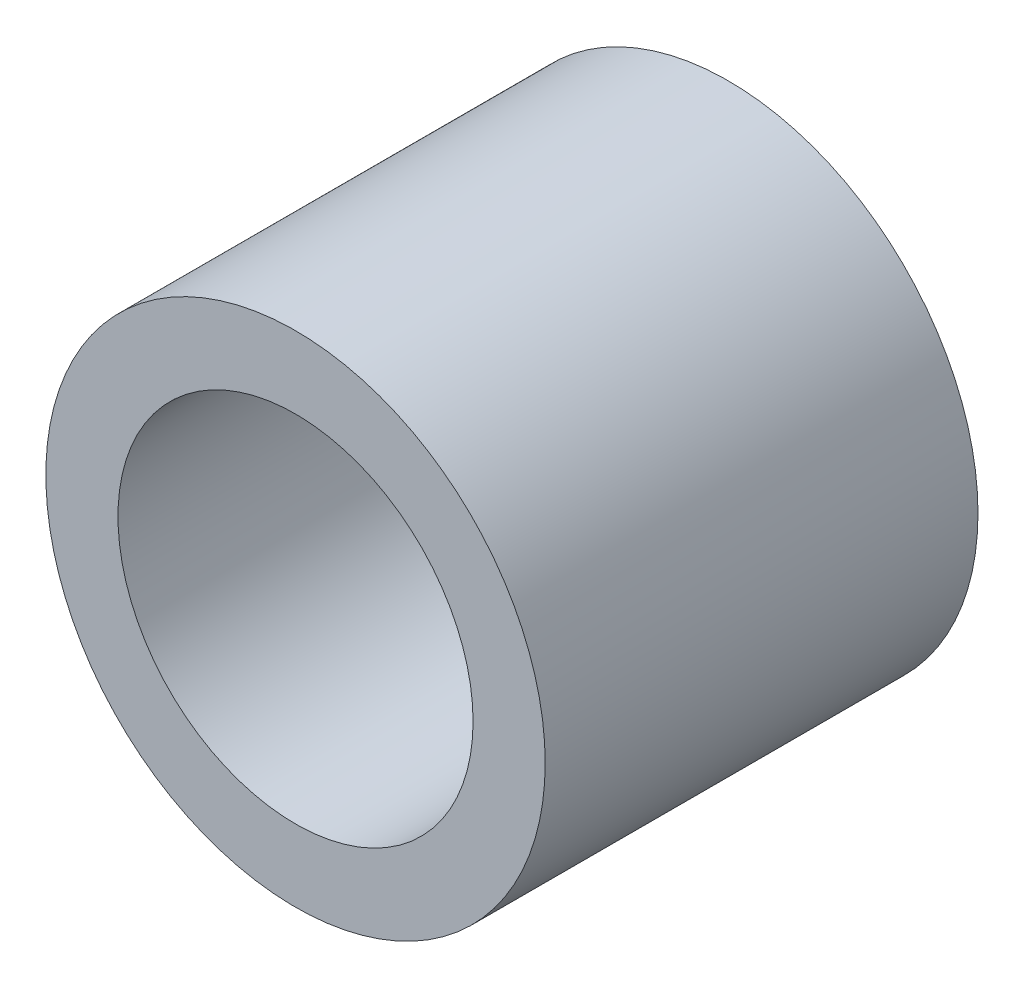
ISO-10303-21;
HEADER;
FILE_DESCRIPTION(('STEP AP214'),'2;1');
FILE_NAME('part.step','',(''),(''),'','','');
FILE_SCHEMA(('AUTOMOTIVE_DESIGN { 1 0 10303 214 1 1 1 1 }'));
ENDSEC;
DATA;
#1=APPLICATION_CONTEXT('core data for automotive mechanical design processes');
#2=APPLICATION_PROTOCOL_DEFINITION('international standard','automotive_design',2000,#1);
#3=PRODUCT_CONTEXT('',#1,'mechanical');
#4=PRODUCT('Part','Part','',(#3));
#5=PRODUCT_RELATED_PRODUCT_CATEGORY('part','',(#4));
#6=PRODUCT_DEFINITION_FORMATION('','',#4);
#7=PRODUCT_DEFINITION_CONTEXT('part definition',#1,'design');
#8=PRODUCT_DEFINITION('design','',#6,#7);
#9=PRODUCT_DEFINITION_SHAPE('','',#8);
#10=(LENGTH_UNIT() NAMED_UNIT(*) SI_UNIT(.MILLI.,.METRE.));
#11=(NAMED_UNIT(*) PLANE_ANGLE_UNIT() SI_UNIT($,.RADIAN.));
#12=(NAMED_UNIT(*) SI_UNIT($,.STERADIAN.) SOLID_ANGLE_UNIT());
#13=UNCERTAINTY_MEASURE_WITH_UNIT(LENGTH_MEASURE(1.E-05),#10,'distance_accuracy_value','');
#14=(GEOMETRIC_REPRESENTATION_CONTEXT(3) GLOBAL_UNCERTAINTY_ASSIGNED_CONTEXT((#13)) GLOBAL_UNIT_ASSIGNED_CONTEXT((#10,
#11,#12)) REPRESENTATION_CONTEXT('',''));
#15=CARTESIAN_POINT('',(0.,0.,0.));
#16=DIRECTION('',(0.,0.,1.));
#17=DIRECTION('',(1.,0.,0.));
#18=AXIS2_PLACEMENT_3D('',#15,#16,#17);
#19=CARTESIAN_POINT('',(0.,0.,39.));
#20=DIRECTION('',(0.,0.,1.));
#21=DIRECTION('',(1.,0.,0.));
#22=AXIS2_PLACEMENT_3D('',#19,#20,#21);
#23=PLANE('',#22);
#24=CARTESIAN_POINT('',(0.,0.,39.));
#25=DIRECTION('',(0.,0.,1.));
#26=DIRECTION('',(1.,0.,0.));
#27=AXIS2_PLACEMENT_3D('',#24,#25,#26);
#28=CIRCLE('',#27,22.5);
#29=CARTESIAN_POINT('',(22.5,0.,39.));
#30=VERTEX_POINT('',#29);
#31=EDGE_CURVE('E10',#30,#30,#28,.T.);
#32=ORIENTED_EDGE('',*,*,#31,.T.);
#33=EDGE_LOOP('',(#32));
#34=FACE_BOUND('',#33,.T.);
#35=CARTESIAN_POINT('',(0.,0.,39.));
#36=DIRECTION('',(0.,0.,1.));
#37=DIRECTION('',(1.,0.,0.));
#38=AXIS2_PLACEMENT_3D('',#35,#36,#37);
#39=CIRCLE('',#38,16.);
#40=CARTESIAN_POINT('',(16.,0.,39.));
#41=VERTEX_POINT('',#40);
#42=EDGE_CURVE('E42',#41,#41,#39,.T.);
#43=ORIENTED_EDGE('',*,*,#42,.F.);
#44=EDGE_LOOP('',(#43));
#45=FACE_BOUND('',#44,.T.);
#46=ADVANCED_FACE('F31',(#34,#45),#23,.T.);
#47=CARTESIAN_POINT('',(0.,0.,0.));
#48=DIRECTION('',(0.,0.,1.));
#49=DIRECTION('',(1.,0.,0.));
#50=AXIS2_PLACEMENT_3D('',#47,#48,#49);
#51=PLANE('',#50);
#52=CARTESIAN_POINT('',(0.,0.,0.));
#53=DIRECTION('',(0.,0.,1.));
#54=DIRECTION('',(1.,0.,0.));
#55=AXIS2_PLACEMENT_3D('',#52,#53,#54);
#56=CIRCLE('',#55,22.5);
#57=CARTESIAN_POINT('',(22.5,0.,0.));
#58=VERTEX_POINT('',#57);
#59=EDGE_CURVE('E35',#58,#58,#56,.T.);
#60=ORIENTED_EDGE('',*,*,#59,.F.);
#61=EDGE_LOOP('',(#60));
#62=FACE_BOUND('',#61,.T.);
#63=CARTESIAN_POINT('',(0.,0.,0.));
#64=DIRECTION('',(0.,0.,1.));
#65=DIRECTION('',(1.,0.,0.));
#66=AXIS2_PLACEMENT_3D('',#63,#64,#65);
#67=CIRCLE('',#66,16.);
#68=CARTESIAN_POINT('',(16.,0.,0.));
#69=VERTEX_POINT('',#68);
#70=EDGE_CURVE('E44',#69,#69,#67,.T.);
#71=ORIENTED_EDGE('',*,*,#70,.T.);
#72=EDGE_LOOP('',(#71));
#73=FACE_BOUND('',#72,.T.);
#74=ADVANCED_FACE('F54',(#62,#73),#51,.F.);
#75=CARTESIAN_POINT('',(0.,0.,39.));
#76=DIRECTION('',(0.,0.,-1.));
#77=DIRECTION('',(-1.,0.,0.));
#78=AXIS2_PLACEMENT_3D('',#75,#76,#77);
#79=CYLINDRICAL_SURFACE('',#78,22.5);
#80=ORIENTED_EDGE('',*,*,#31,.F.);
#81=EDGE_LOOP('',(#80));
#82=FACE_BOUND('',#81,.T.);
#83=ORIENTED_EDGE('',*,*,#59,.T.);
#84=EDGE_LOOP('',(#83));
#85=FACE_BOUND('',#84,.T.);
#86=ADVANCED_FACE('F33',(#82,#85),#79,.T.);
#87=CARTESIAN_POINT('',(0.,0.,39.));
#88=DIRECTION('',(0.,0.,-1.));
#89=DIRECTION('',(-1.,0.,0.));
#90=AXIS2_PLACEMENT_3D('',#87,#88,#89);
#91=CYLINDRICAL_SURFACE('',#90,16.);
#92=ORIENTED_EDGE('',*,*,#42,.T.);
#93=EDGE_LOOP('',(#92));
#94=FACE_BOUND('',#93,.T.);
#95=ORIENTED_EDGE('',*,*,#70,.F.);
#96=EDGE_LOOP('',(#95));
#97=FACE_BOUND('',#96,.T.);
#98=ADVANCED_FACE('F50',(#94,#97),#91,.F.);
#99=CLOSED_SHELL('',(#46,#74,#86,#98));
#100=MANIFOLD_SOLID_BREP('B2',#99);
#101=ADVANCED_BREP_SHAPE_REPRESENTATION('',(#18,#100),#14);
#102=SHAPE_DEFINITION_REPRESENTATION(#9,#101);
ENDSEC;
END-ISO-10303-21;
